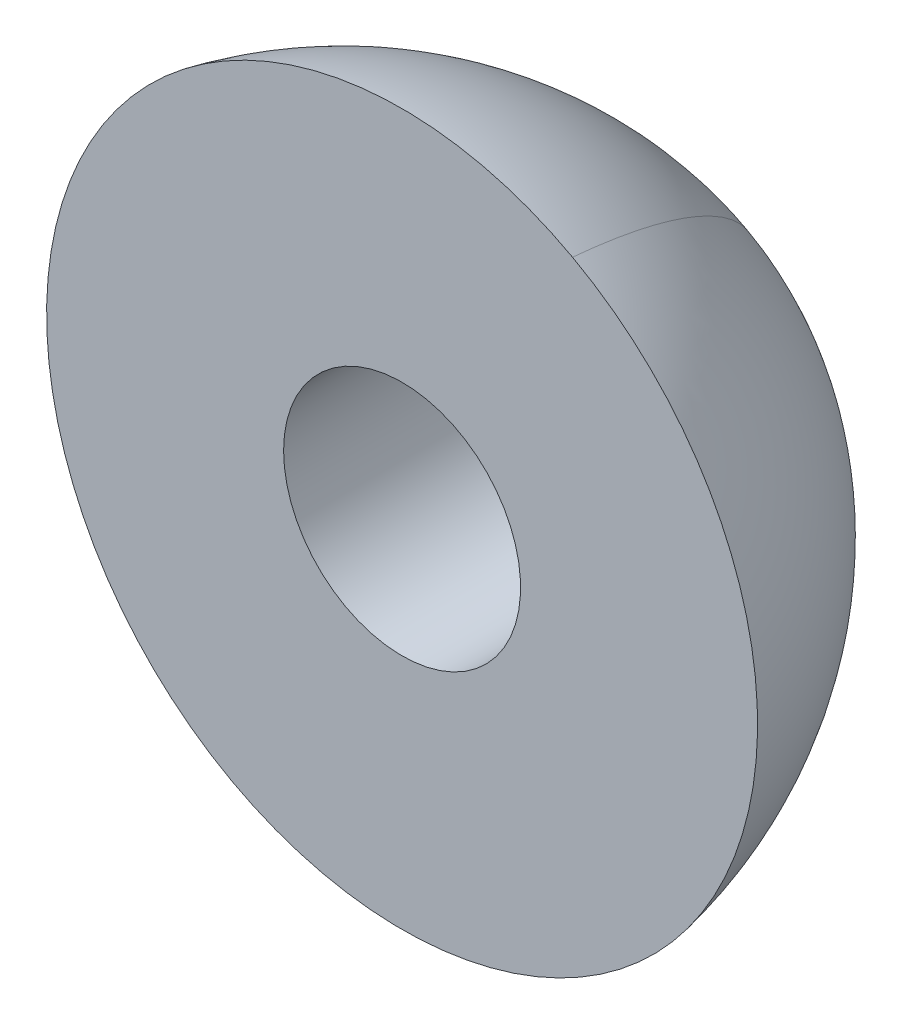
ISO-10303-21;
HEADER;
FILE_DESCRIPTION(('STEP AP214'),'2;1');
FILE_NAME('part.step','',(''),(''),'','','');
FILE_SCHEMA(('AUTOMOTIVE_DESIGN { 1 0 10303 214 1 1 1 1 }'));
ENDSEC;
DATA;
#1=APPLICATION_CONTEXT('core data for automotive mechanical design processes');
#2=APPLICATION_PROTOCOL_DEFINITION('international standard','automotive_design',2000,#1);
#3=PRODUCT_CONTEXT('',#1,'mechanical');
#4=PRODUCT('Part','Part','',(#3));
#5=PRODUCT_RELATED_PRODUCT_CATEGORY('part','',(#4));
#6=PRODUCT_DEFINITION_FORMATION('','',#4);
#7=PRODUCT_DEFINITION_CONTEXT('part definition',#1,'design');
#8=PRODUCT_DEFINITION('design','',#6,#7);
#9=PRODUCT_DEFINITION_SHAPE('','',#8);
#10=(LENGTH_UNIT() NAMED_UNIT(*) SI_UNIT(.MILLI.,.METRE.));
#11=(NAMED_UNIT(*) PLANE_ANGLE_UNIT() SI_UNIT($,.RADIAN.));
#12=(NAMED_UNIT(*) SI_UNIT($,.STERADIAN.) SOLID_ANGLE_UNIT());
#13=UNCERTAINTY_MEASURE_WITH_UNIT(LENGTH_MEASURE(1.E-05),#10,'distance_accuracy_value','');
#14=(GEOMETRIC_REPRESENTATION_CONTEXT(3) GLOBAL_UNCERTAINTY_ASSIGNED_CONTEXT((#13)) GLOBAL_UNIT_ASSIGNED_CONTEXT((#10,
#11,#12)) REPRESENTATION_CONTEXT('',''));
#15=CARTESIAN_POINT('',(0.,0.,0.));
#16=DIRECTION('',(0.,0.,1.));
#17=DIRECTION('',(1.,0.,0.));
#18=AXIS2_PLACEMENT_3D('',#15,#16,#17);
#19=CARTESIAN_POINT('',(8.412655328604,-3.67345046583847,-7.02));
#20=CARTESIAN_POINT('',(8.27820515603502,-3.6,-7.02));
#21=CARTESIAN_POINT('',(8.125,-3.6,-7.02));
#22=CARTESIAN_POINT('',(7.525,-3.6,-7.02));
#23=CARTESIAN_POINT('',(7.525,-4.2,-7.02));
#24=CARTESIAN_POINT('',(7.525,-4.8,-7.02));
#25=CARTESIAN_POINT('',(8.125,-4.8,-7.02));
#26=CARTESIAN_POINT('',(8.725,-4.8,-7.02));
#27=CARTESIAN_POINT('',(8.725,-4.2,-7.02));
#28=CARTESIAN_POINT('',(8.725,-3.84408514170272,-7.02));
#29=CARTESIAN_POINT('',(8.412655328604,-3.67345046583847,-7.02));
#30=CARTESIAN_POINT('',(8.39684211634302,-3.70239635601204,-7.18295627713));
#31=CARTESIAN_POINT('',(8.26978304314174,-3.63298366626,-7.18295627713));
#32=CARTESIAN_POINT('',(8.125,-3.63298366626,-7.18295627713));
#33=CARTESIAN_POINT('',(7.55798366626,-3.63298366626,-7.18295627713));
#34=CARTESIAN_POINT('',(7.55798366626,-4.2,-7.18295627713));
#35=CARTESIAN_POINT('',(7.55798366626,-4.76701633374,-7.18295627713));
#36=CARTESIAN_POINT('',(8.125,-4.76701633374,-7.18295627713));
#37=CARTESIAN_POINT('',(8.69201633374,-4.76701633374,-7.18295627713));
#38=CARTESIAN_POINT('',(8.69201633374,-4.2,-7.18295627713));
#39=CARTESIAN_POINT('',(8.69201633374,-3.86365076987447,-7.18295627713));
#40=CARTESIAN_POINT('',(8.39684211634302,-3.70239635601204,-7.18295627713));
#41=CARTESIAN_POINT('',(8.35618670725368,-3.77681558134337,-7.33577286233));
#42=CARTESIAN_POINT('',(8.24812998243388,-3.71778392208,-7.33577286233));
#43=CARTESIAN_POINT('',(8.125,-3.71778392208,-7.33577286233));
#44=CARTESIAN_POINT('',(7.64278392208,-3.71778392208,-7.33577286233));
#45=CARTESIAN_POINT('',(7.64278392208,-4.2,-7.33577286233));
#46=CARTESIAN_POINT('',(7.64278392208,-4.68221607792,-7.33577286233));
#47=CARTESIAN_POINT('',(8.125,-4.68221607792,-7.33577286233));
#48=CARTESIAN_POINT('',(8.60721607792,-4.68221607792,-7.33577286233));
#49=CARTESIAN_POINT('',(8.60721607792,-4.2,-7.33577286233));
#50=CARTESIAN_POINT('',(8.60721607792,-3.91395355493072,-7.33577286233));
#51=CARTESIAN_POINT('',(8.35618670725368,-3.77681558134337,-7.33577286233));
#52=CARTESIAN_POINT('',(8.29363382138873,-3.89131786806441,-7.45204992331));
#53=CARTESIAN_POINT('',(8.21481433107471,-3.8482585832,-7.45204992331));
#54=CARTESIAN_POINT('',(8.125,-3.8482585832,-7.45204992331));
#55=CARTESIAN_POINT('',(7.7732585832,-3.8482585832,-7.45204992331));
#56=CARTESIAN_POINT('',(7.7732585832,-4.2,-7.45204992331));
#57=CARTESIAN_POINT('',(7.7732585832,-4.5517414168,-7.45204992331));
#58=CARTESIAN_POINT('',(8.125,-4.5517414168,-7.45204992331));
#59=CARTESIAN_POINT('',(8.4767414168,-4.5517414168,-7.45204992331));
#60=CARTESIAN_POINT('',(8.4767414168,-4.2,-7.45204992331));
#61=CARTESIAN_POINT('',(8.4767414168,-3.99135000580391,-7.45204992331));
#62=CARTESIAN_POINT('',(8.29363382138873,-3.89131786806441,-7.45204992331));
#63=CARTESIAN_POINT('',(8.22088510953467,-4.02448348861282,-7.52));
#64=CARTESIAN_POINT('',(8.17606838534501,-4.,-7.52));
#65=CARTESIAN_POINT('',(8.125,-4.,-7.52));
#66=CARTESIAN_POINT('',(7.925,-4.,-7.52));
#67=CARTESIAN_POINT('',(7.925,-4.2,-7.52));
#68=CARTESIAN_POINT('',(7.925,-4.4,-7.52));
#69=CARTESIAN_POINT('',(8.125,-4.4,-7.52));
#70=CARTESIAN_POINT('',(8.325,-4.4,-7.52));
#71=CARTESIAN_POINT('',(8.325,-4.2,-7.52));
#72=CARTESIAN_POINT('',(8.325,-4.08136171390091,-7.52));
#73=CARTESIAN_POINT('',(8.22088510953467,-4.02448348861282,-7.52));
#74=(BOUNDED_SURFACE() B_SPLINE_SURFACE(4,2,((#19,#20,#21,#22,#23,#24,#25,#26,#27,#28,#29),(#30,
#31,#32,#33,#34,#35,#36,#37,#38,#39,#40),(#41,#42,#43,#44,#45,#46,#47,#48,#49,#50,#51),(#52,#53,
#54,#55,#56,#57,#58,#59,#60,#61,#62),(#63,#64,#65,#66,#67,#68,#69,#70,#71,#72,#73)),
.UNSPECIFIED.,.F.,.T.,.F.) B_SPLINE_SURFACE_WITH_KNOTS((5,5),(3,2,2,2,2,3),(3.59338935395,
4.25843275699),(5.77021321442228,6.28318530717959,7.85398163397448,9.42477796076938,
10.9955742875643,12.0533985216019),
.UNSPECIFIED.) GEOMETRIC_REPRESENTATION_ITEM() RATIONAL_B_SPLINE_SURFACE(((0.871173024928758,
0.904350395499252,1.,0.707106781186548,1.,0.707106781186548,1.,0.707106781186548,1.,
0.802756385687296,0.871173024928758),(0.871173024928758,0.904350395499252,1.,0.707106781186548,
1.,0.707106781186548,1.,0.707106781186548,1.,0.802756385687296,0.871173024928758),
(0.871173024928758,0.904350395499252,1.,0.707106781186548,1.,0.707106781186548,1.,
0.707106781186548,1.,0.802756385687296,0.871173024928758),(0.871173024928758,0.904350395499252,
1.,0.707106781186548,1.,0.707106781186548,1.,0.707106781186548,1.,0.802756385687296,
0.871173024928758),(0.871173024928758,0.904350395499252,1.,0.707106781186548,1.,
0.707106781186548,1.,0.707106781186548,1.,0.802756385687296,0.871173024928758))) REPRESENTATION_ITEM('') SURFACE());
#75=CARTESIAN_POINT('',(8.125,-4.20000000000003,-7.02));
#76=DIRECTION('',(0.,0.,1.));
#77=DIRECTION('',(0.,-1.,0.));
#78=AXIS2_PLACEMENT_3D('',#75,#76,#77);
#79=CIRCLE('',#78,0.600000000000027);
#80=CARTESIAN_POINT('',(8.41265532497554,-3.67345046385623,-7.02));
#81=VERTEX_POINT('',#80);
#82=CARTESIAN_POINT('',(7.83734467684184,-4.72654953713663,-7.02));
#83=VERTEX_POINT('',#82);
#84=EDGE_CURVE('E53',#81,#83,#79,.T.);
#85=CARTESIAN_POINT('',(8.412655328604,-3.67345046583847,-7.02));
#86=CARTESIAN_POINT('',(8.41265408956008,-3.67345273389318,-7.02001276843559));
#87=CARTESIAN_POINT('',(8.41265285034511,-3.67345500226091,-7.02002553679603));
#88=CARTESIAN_POINT('',(8.41265037157201,-3.67345953962452,-7.02005107337679));
#89=CARTESIAN_POINT('',(8.41264913201386,-3.6734618086204,-7.02006384159712));
#90=CARTESIAN_POINT('',(8.41143774251333,-3.67567924213689,-7.03254011116957));
#91=CARTESIAN_POINT('',(8.41006398934778,-3.67819388031071,-7.04493731931968));
#92=CARTESIAN_POINT('',(8.40703959714754,-3.68372999285266,-7.06919583108301));
#93=CARTESIAN_POINT('',(8.40539822220022,-3.68673450942241,-7.08106220869049));
#94=CARTESIAN_POINT('',(8.40187119689025,-3.6931906857004,-7.10424170008439));
#95=CARTESIAN_POINT('',(8.39999443866325,-3.69662606846393,-7.11556069121987));
#96=CARTESIAN_POINT('',(8.39602838123962,-3.70388588762341,-7.13763229997556));
#97=CARTESIAN_POINT('',(8.39394756836654,-3.70769478990855,-7.14839155807181));
#98=CARTESIAN_POINT('',(8.38960179324017,-3.71564967765521,-7.16934699954795));
#99=CARTESIAN_POINT('',(8.38734466697633,-3.7197813194345,-7.17955025452401));
#100=CARTESIAN_POINT('',(8.38267717623925,-3.72832510365255,-7.19938107889738));
#101=CARTESIAN_POINT('',(8.38027446487031,-3.73272323717805,-7.20901648790328));
#102=CARTESIAN_POINT('',(8.37534361839893,-3.74174909083291,-7.22771462965517));
#103=CARTESIAN_POINT('',(8.37282269798365,-3.74636360456616,-7.2367856423262));
#104=CARTESIAN_POINT('',(8.36768179318607,-3.75577396740857,-7.25436192802938));
#105=CARTESIAN_POINT('',(8.36506858664528,-3.76055740976224,-7.26287582863639));
#106=CARTESIAN_POINT('',(8.35976797887575,-3.77026010693629,-7.27934820712469));
#107=CARTESIAN_POINT('',(8.35708692463806,-3.77516774366765,-7.28731557327513));
#108=CARTESIAN_POINT('',(8.35167398362116,-3.78507606547563,-7.30270805851633));
#109=CARTESIAN_POINT('',(8.3489480223809,-3.79006590392608,-7.31014224601188));
#110=CARTESIAN_POINT('',(8.34346711990865,-3.80009862834883,-7.32448393424244));
#111=CARTESIAN_POINT('',(8.34071769479031,-3.8051314171429,-7.33140060901915));
#112=CARTESIAN_POINT('',(8.33521022051937,-3.81521278092322,-7.34472477816495));
#113=CARTESIAN_POINT('',(8.33245729195438,-3.82025198273679,-7.35114148366042));
#114=CARTESIAN_POINT('',(8.32696168851671,-3.83031161710983,-7.36348477528605));
#115=CARTESIAN_POINT('',(8.32422375419262,-3.8353233721534,-7.36942054627298));
#116=CARTESIAN_POINT('',(8.31877558997386,-3.84529616962684,-7.38082219384313));
#117=CARTESIAN_POINT('',(8.31606973624037,-3.85024920154747,-7.38629717198195));
#118=CARTESIAN_POINT('',(8.31070173812569,-3.86007525596057,-7.39679838363599));
#119=CARTESIAN_POINT('',(8.30804362454402,-3.86494090012404,-7.40183357896159));
#120=CARTESIAN_POINT('',(8.30278592860607,-3.87456504776641,-7.4114766764742));
#121=CARTESIAN_POINT('',(8.30019004082482,-3.87931678837113,-7.41609336415478));
#122=CARTESIAN_POINT('',(8.29271723310575,-3.89299567084612,-7.42897838401917));
#123=CARTESIAN_POINT('',(8.28776061897803,-3.90206869195195,-7.43704726284006));
#124=CARTESIAN_POINT('',(8.27821598549041,-3.9195400259887,-7.45170495070122));
#125=CARTESIAN_POINT('',(8.27365041417128,-3.92789724805669,-7.45835760011105));
#126=CARTESIAN_POINT('',(8.26496458189323,-3.94379655706939,-7.4703551567974));
#127=CARTESIAN_POINT('',(8.26086274490288,-3.95130491916572,-7.47575811548112));
#128=CARTESIAN_POINT('',(8.25316595001694,-3.96539380742329,-7.48541639791882));
#129=CARTESIAN_POINT('',(8.24958582454608,-3.97194718301289,-7.48972322274914));
#130=CARTESIAN_POINT('',(8.24298039980879,-3.98403833166425,-7.4973339134358));
#131=CARTESIAN_POINT('',(8.23996680149409,-3.98955468627665,-7.50068200910046));
#132=CARTESIAN_POINT('',(8.23453100232078,-3.99950484974416,-7.50650070358714));
#133=CARTESIAN_POINT('',(8.23211774928579,-4.00392227971725,-7.5090077361691));
#134=CARTESIAN_POINT('',(8.22677529938803,-4.01370156851142,-7.51439097662996));
#135=CARTESIAN_POINT('',(8.22383984231594,-4.01907488657313,-7.51724017713069));
#136=CARTESIAN_POINT('',(8.22088510953467,-4.02448348861282,-7.52));
#137=B_SPLINE_CURVE_WITH_KNOTS('',3,(#85,#86,#87,#88,#89,#90,#91,#92,#93,#94,#95,#96,#97,#98,
#99,#100,#101,#102,#103,#104,#105,#106,#107,#108,#109,#110,#111,#112,#113,#114,#115,#116,#117,
#118,#119,#120,#121,#122,#123,#124,#125,#126,#127,#128,#129,#130,#131,#132,#133,#134,#135,#136),
.UNSPECIFIED.,.F.,.F.,(4,2,2,2,2,2,2,2,2,2,2,2,2,2,2,2,2,2,2,2,2,2,2,2,2,4),(0.,
3.90820904272062E-05,7.81641949984842E-05,0.0382277659151415,0.0752625764291833,
0.111176992986509,0.145967816151045,0.17966597534005,0.212236733737831,0.243680700668723,
0.273998924203184,0.303192621618793,0.331262986670023,0.358211062602344,0.384037669230352,
0.408743372593876,0.432328486472262,0.454793096176895,0.476137096392951,0.515458296377026,
0.550294211846126,0.580641370925242,0.606496983412368,0.627859381614811,0.644728034357342,
0.664985304140962),.UNSPECIFIED.);
#138=CARTESIAN_POINT('',(8.2208851081732,-4.02448348786905,-7.52));
#139=VERTEX_POINT('',#138);
#140=EDGE_CURVE('E42',#81,#139,#137,.T.);
#141=CARTESIAN_POINT('',(8.125,-4.20000000000001,-7.52));
#142=DIRECTION('',(0.,0.,-1.));
#143=DIRECTION('',(-1.,0.,0.));
#144=AXIS2_PLACEMENT_3D('',#141,#142,#143);
#145=CIRCLE('',#144,0.199999999999997);
#146=CARTESIAN_POINT('',(8.02911489227989,-4.37551651237848,-7.52));
#147=VERTEX_POINT('',#146);
#148=EDGE_CURVE('E51',#147,#139,#145,.T.);
#149=CARTESIAN_POINT('',(7.83734467684185,-4.72654953713661,-7.02));
#150=CARTESIAN_POINT('',(7.85315788880345,-4.69760364679949,-7.18295627713));
#151=CARTESIAN_POINT('',(7.89381329712311,-4.62318442104768,-7.33577286233));
#152=CARTESIAN_POINT('',(7.95636618180382,-4.50868213367969,-7.45204992331));
#153=CARTESIAN_POINT('',(8.02911489228062,-4.37551651237887,-7.52));
#154=B_SPLINE_CURVE_WITH_KNOTS('',4,(#149,#150,#151,#152,#153),.UNSPECIFIED.,.F.,.F.,(5,5),
(3.59338935395,4.25843275699),.UNSPECIFIED.);
#155=EDGE_CURVE('E35',#147,#83,#154,.F.);
#156=ORIENTED_EDGE('',*,*,#84,.F.);
#157=ORIENTED_EDGE('',*,*,#140,.T.);
#158=ORIENTED_EDGE('',*,*,#148,.F.);
#159=ORIENTED_EDGE('',*,*,#155,.T.);
#160=EDGE_LOOP('',(#156,#157,#158,#159));
#161=FACE_BOUND('',#160,.T.);
#162=ADVANCED_FACE('F17',(#161),#74,.T.);
#163=CARTESIAN_POINT('',(8.125,-4.20000000000001,-7.02));
#164=DIRECTION('',(0.,0.,-1.));
#165=DIRECTION('',(-1.,0.,0.));
#166=AXIS2_PLACEMENT_3D('',#163,#164,#165);
#167=CYLINDRICAL_SURFACE('',#166,0.199999999999997);
#168=CARTESIAN_POINT('',(8.125,-4.2,-7.52));
#169=DIRECTION('',(0.,0.,1.));
#170=DIRECTION('',(1.,0.,0.));
#171=AXIS2_PLACEMENT_3D('',#168,#169,#170);
#172=CIRCLE('',#171,0.2);
#173=EDGE_CURVE('E27',#147,#139,#172,.T.);
#174=ORIENTED_EDGE('',*,*,#173,.F.);
#175=ORIENTED_EDGE('',*,*,#148,.T.);
#176=EDGE_LOOP('',(#174,#175));
#177=FACE_BOUND('',#176,.T.);
#178=CARTESIAN_POINT('',(8.125,-4.20000000000001,-7.02));
#179=DIRECTION('',(0.,0.,-1.));
#180=DIRECTION('',(-1.,0.,0.));
#181=AXIS2_PLACEMENT_3D('',#178,#179,#180);
#182=CIRCLE('',#181,0.199999999999997);
#183=CARTESIAN_POINT('',(7.925,-4.20000000000001,-7.02));
#184=VERTEX_POINT('',#183);
#185=EDGE_CURVE('E57',#184,#184,#182,.T.);
#186=ORIENTED_EDGE('',*,*,#185,.F.);
#187=EDGE_LOOP('',(#186));
#188=FACE_BOUND('',#187,.T.);
#189=ADVANCED_FACE('F55',(#177,#188),#167,.F.);
#190=CARTESIAN_POINT('',(8.94020486029457,-3.38479513970218,-7.02));
#191=DIRECTION('',(0.,0.,1.));
#192=DIRECTION('',(-1.,0.,0.));
#193=AXIS2_PLACEMENT_3D('',#190,#191,#192);
#194=PLANE('',#193);
#195=ORIENTED_EDGE('',*,*,#185,.T.);
#196=EDGE_LOOP('',(#195));
#197=FACE_BOUND('',#196,.T.);
#198=CARTESIAN_POINT('',(8.125,-4.2,-7.02));
#199=DIRECTION('',(0.,0.,1.));
#200=DIRECTION('',(1.,0.,0.));
#201=AXIS2_PLACEMENT_3D('',#198,#199,#200);
#202=CIRCLE('',#201,0.6);
#203=EDGE_CURVE('E11',#81,#83,#202,.F.);
#204=ORIENTED_EDGE('',*,*,#203,.F.);
#205=ORIENTED_EDGE('',*,*,#84,.T.);
#206=EDGE_LOOP('',(#204,#205));
#207=FACE_BOUND('',#206,.T.);
#208=ADVANCED_FACE('F19',(#197,#207),#194,.T.);
#209=CARTESIAN_POINT('',(8.125,-3.6,-7.02));
#210=CARTESIAN_POINT('',(7.525,-3.6,-7.02));
#211=CARTESIAN_POINT('',(7.525,-4.2,-7.02));
#212=CARTESIAN_POINT('',(7.525,-4.8,-7.02));
#213=CARTESIAN_POINT('',(8.125,-4.8,-7.02));
#214=CARTESIAN_POINT('',(8.725,-4.8,-7.02));
#215=CARTESIAN_POINT('',(8.725,-4.2,-7.02));
#216=CARTESIAN_POINT('',(8.725,-3.6,-7.02));
#217=CARTESIAN_POINT('',(8.125,-3.6,-7.02));
#218=CARTESIAN_POINT('',(8.125,-3.63298366626,-7.18295627713));
#219=CARTESIAN_POINT('',(7.55798366626,-3.63298366626,-7.18295627713));
#220=CARTESIAN_POINT('',(7.55798366626,-4.2,-7.18295627713));
#221=CARTESIAN_POINT('',(7.55798366626,-4.76701633374,-7.18295627713));
#222=CARTESIAN_POINT('',(8.125,-4.76701633374,-7.18295627713));
#223=CARTESIAN_POINT('',(8.69201633374,-4.76701633374,-7.18295627713));
#224=CARTESIAN_POINT('',(8.69201633374,-4.2,-7.18295627713));
#225=CARTESIAN_POINT('',(8.69201633374,-3.63298366626,-7.18295627713));
#226=CARTESIAN_POINT('',(8.125,-3.63298366626,-7.18295627713));
#227=CARTESIAN_POINT('',(8.125,-3.71778392208,-7.33577286233));
#228=CARTESIAN_POINT('',(7.64278392208,-3.71778392208,-7.33577286233));
#229=CARTESIAN_POINT('',(7.64278392208,-4.2,-7.33577286233));
#230=CARTESIAN_POINT('',(7.64278392208,-4.68221607792,-7.33577286233));
#231=CARTESIAN_POINT('',(8.125,-4.68221607792,-7.33577286233));
#232=CARTESIAN_POINT('',(8.60721607792,-4.68221607792,-7.33577286233));
#233=CARTESIAN_POINT('',(8.60721607792,-4.2,-7.33577286233));
#234=CARTESIAN_POINT('',(8.60721607792,-3.71778392208,-7.33577286233));
#235=CARTESIAN_POINT('',(8.125,-3.71778392208,-7.33577286233));
#236=CARTESIAN_POINT('',(8.125,-3.8482585832,-7.45204992331));
#237=CARTESIAN_POINT('',(7.7732585832,-3.8482585832,-7.45204992331));
#238=CARTESIAN_POINT('',(7.7732585832,-4.2,-7.45204992331));
#239=CARTESIAN_POINT('',(7.7732585832,-4.5517414168,-7.45204992331));
#240=CARTESIAN_POINT('',(8.125,-4.5517414168,-7.45204992331));
#241=CARTESIAN_POINT('',(8.4767414168,-4.5517414168,-7.45204992331));
#242=CARTESIAN_POINT('',(8.4767414168,-4.2,-7.45204992331));
#243=CARTESIAN_POINT('',(8.4767414168,-3.8482585832,-7.45204992331));
#244=CARTESIAN_POINT('',(8.125,-3.8482585832,-7.45204992331));
#245=CARTESIAN_POINT('',(8.125,-4.,-7.52));
#246=CARTESIAN_POINT('',(7.925,-4.,-7.52));
#247=CARTESIAN_POINT('',(7.925,-4.2,-7.52));
#248=CARTESIAN_POINT('',(7.925,-4.4,-7.52));
#249=CARTESIAN_POINT('',(8.125,-4.4,-7.52));
#250=CARTESIAN_POINT('',(8.325,-4.4,-7.52));
#251=CARTESIAN_POINT('',(8.325,-4.2,-7.52));
#252=CARTESIAN_POINT('',(8.325,-4.,-7.52));
#253=CARTESIAN_POINT('',(8.125,-4.,-7.52));
#254=(BOUNDED_SURFACE() B_SPLINE_SURFACE(4,2,((#209,#210,#211,#212,#213,#214,#215,#216,#217),
(#218,#219,#220,#221,#222,#223,#224,#225,#226),(#227,#228,#229,#230,#231,#232,#233,#234,#235),
(#236,#237,#238,#239,#240,#241,#242,#243,#244),(#245,#246,#247,#248,#249,#250,#251,#252,#253)),
.UNSPECIFIED.,.F.,.T.,.F.) B_SPLINE_SURFACE_WITH_KNOTS((5,5),(3,2,2,2,3),(3.59338935395,
4.25843275699),(0.,1.5707963267949,3.14159265358979,4.71238898038469,6.28318530717959),
.UNSPECIFIED.) GEOMETRIC_REPRESENTATION_ITEM() RATIONAL_B_SPLINE_SURFACE(((1.,0.707106781186548,
1.,0.707106781186548,1.,0.707106781186548,1.,0.707106781186548,1.),(1.,0.707106781186548,1.,
0.707106781186548,1.,0.707106781186548,1.,0.707106781186548,1.),(1.,0.707106781186548,1.,
0.707106781186548,1.,0.707106781186548,1.,0.707106781186548,1.),(1.,0.707106781186548,1.,
0.707106781186548,1.,0.707106781186548,1.,0.707106781186548,1.),(1.,0.707106781186548,1.,
0.707106781186548,1.,0.707106781186548,1.,0.707106781186548,1.))) REPRESENTATION_ITEM('') SURFACE());
#255=ORIENTED_EDGE('',*,*,#203,.T.);
#256=ORIENTED_EDGE('',*,*,#155,.F.);
#257=ORIENTED_EDGE('',*,*,#173,.T.);
#258=ORIENTED_EDGE('',*,*,#140,.F.);
#259=EDGE_LOOP('',(#255,#256,#257,#258));
#260=FACE_BOUND('',#259,.T.);
#261=ADVANCED_FACE('F47',(#260),#254,.T.);
#262=CLOSED_SHELL('',(#162,#189,#208,#261));
#263=MANIFOLD_SOLID_BREP('B1',#262);
#264=ADVANCED_BREP_SHAPE_REPRESENTATION('',(#18,#263),#14);
#265=SHAPE_DEFINITION_REPRESENTATION(#9,#264);
ENDSEC;
END-ISO-10303-21;
